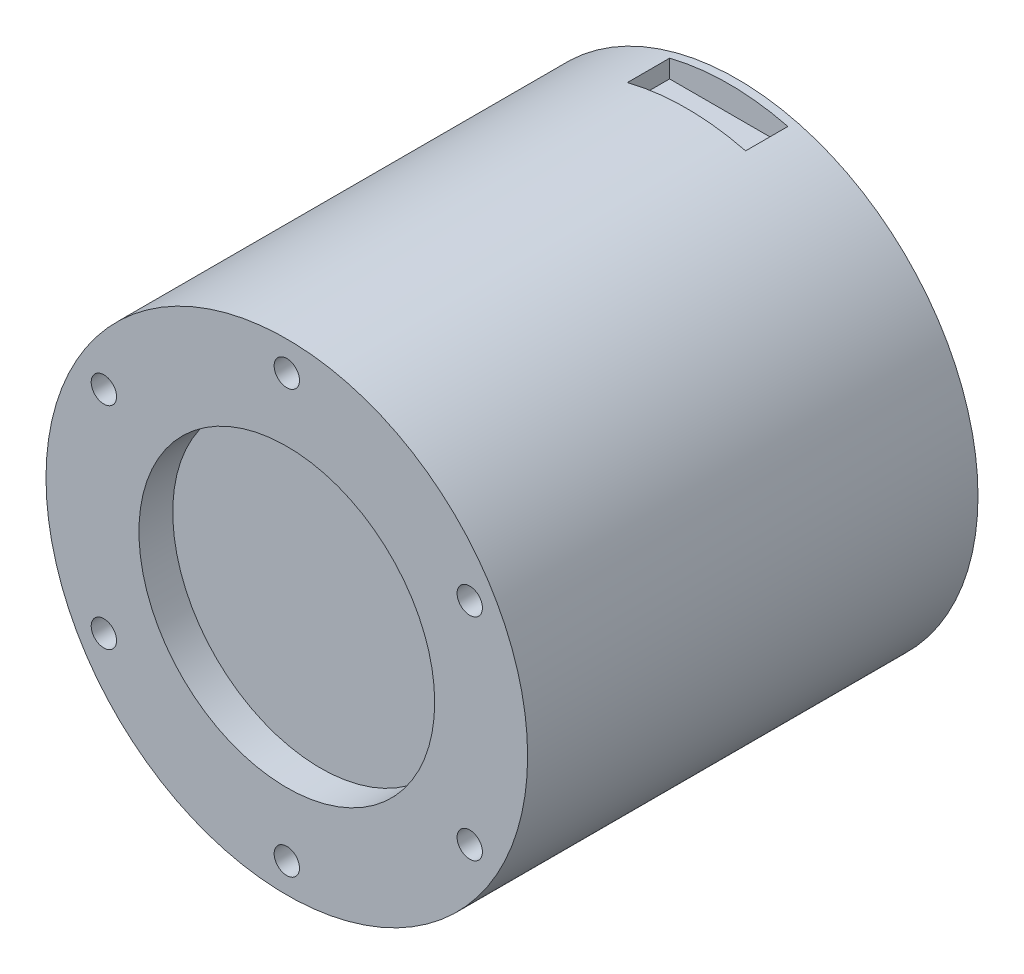
ISO-10303-21;
HEADER;
FILE_DESCRIPTION(('STEP AP214'),'2;1');
FILE_NAME('part.step','',(''),(''),'','','');
FILE_SCHEMA(('AUTOMOTIVE_DESIGN { 1 0 10303 214 1 1 1 1 }'));
ENDSEC;
DATA;
#1=APPLICATION_CONTEXT('core data for automotive mechanical design processes');
#2=APPLICATION_PROTOCOL_DEFINITION('international standard','automotive_design',2000,#1);
#3=PRODUCT_CONTEXT('',#1,'mechanical');
#4=PRODUCT('Part','Part','',(#3));
#5=PRODUCT_RELATED_PRODUCT_CATEGORY('part','',(#4));
#6=PRODUCT_DEFINITION_FORMATION('','',#4);
#7=PRODUCT_DEFINITION_CONTEXT('part definition',#1,'design');
#8=PRODUCT_DEFINITION('design','',#6,#7);
#9=PRODUCT_DEFINITION_SHAPE('','',#8);
#10=(LENGTH_UNIT() NAMED_UNIT(*) SI_UNIT(.MILLI.,.METRE.));
#11=(NAMED_UNIT(*) PLANE_ANGLE_UNIT() SI_UNIT($,.RADIAN.));
#12=(NAMED_UNIT(*) SI_UNIT($,.STERADIAN.) SOLID_ANGLE_UNIT());
#13=UNCERTAINTY_MEASURE_WITH_UNIT(LENGTH_MEASURE(1.E-05),#10,'distance_accuracy_value','');
#14=(GEOMETRIC_REPRESENTATION_CONTEXT(3) GLOBAL_UNCERTAINTY_ASSIGNED_CONTEXT((#13)) GLOBAL_UNIT_ASSIGNED_CONTEXT((#10,
#11,#12)) REPRESENTATION_CONTEXT('',''));
#15=CARTESIAN_POINT('',(0.,0.,0.));
#16=DIRECTION('',(0.,0.,1.));
#17=DIRECTION('',(1.,0.,0.));
#18=AXIS2_PLACEMENT_3D('',#15,#16,#17);
#19=CARTESIAN_POINT('',(0.,0.,53.3));
#20=DIRECTION('',(0.,0.,-1.));
#21=DIRECTION('',(-1.,0.,0.));
#22=AXIS2_PLACEMENT_3D('',#19,#20,#21);
#23=CYLINDRICAL_SURFACE('',#22,28.5);
#24=CARTESIAN_POINT('',(6.99999999976047,27.6269795671433,-4.8311518948453));
#25=CARTESIAN_POINT('',(6.99999999986288,27.6269795671173,-2.0541012632302));
#26=CARTESIAN_POINT('',(6.99999999996529,27.6269795670914,0.722949368384905));
#27=CARTESIAN_POINT('',(7.00000000017012,27.6269795670395,6.27705063161511));
#28=CARTESIAN_POINT('',(7.00000000027253,27.6269795670136,9.0541012632302));
#29=CARTESIAN_POINT('',(7.00000000037494,27.6269795669876,11.8311518948453));
#30=B_SPLINE_CURVE_WITH_KNOTS('',3,(#24,#25,#26,#27,#28,#29),.UNSPECIFIED.,.F.,.F.,(4,2,4),(0.,
8.3311518948453,16.6623037896906),.UNSPECIFIED.);
#31=CARTESIAN_POINT('',(6.99999999997551,27.6269795670888,1.));
#32=VERTEX_POINT('',#31);
#33=CARTESIAN_POINT('',(7.0000000001599,27.6269795670421,6.00000000000001));
#34=VERTEX_POINT('',#33);
#35=EDGE_CURVE('E275',#32,#34,#30,.T.);
#36=ORIENTED_EDGE('',*,*,#35,.T.);
#37=CARTESIAN_POINT('',(0.,0.,6.00000000000001));
#38=DIRECTION('',(0.,0.,1.));
#39=DIRECTION('',(1.,0.,0.));
#40=AXIS2_PLACEMENT_3D('',#37,#38,#39);
#41=CIRCLE('',#40,28.5);
#42=CARTESIAN_POINT('',(-6.9999999998401,27.6269795671231,6.));
#43=VERTEX_POINT('',#42);
#44=EDGE_CURVE('E266',#34,#43,#41,.T.);
#45=ORIENTED_EDGE('',*,*,#44,.T.);
#46=DIRECTION('',(0.,0.,-1.));
#47=VECTOR('',#46,1.);
#48=CARTESIAN_POINT('',(-6.99999999984013,27.6269795671231,53.3));
#49=LINE('',#48,#47);
#50=CARTESIAN_POINT('',(-6.99999999984013,27.6269795671231,1.00000000000001));
#51=VERTEX_POINT('',#50);
#52=EDGE_CURVE('E272',#43,#51,#49,.T.);
#53=ORIENTED_EDGE('',*,*,#52,.T.);
#54=CARTESIAN_POINT('',(0.,0.,1.));
#55=DIRECTION('',(0.,0.,-1.));
#56=DIRECTION('',(-1.,0.,0.));
#57=AXIS2_PLACEMENT_3D('',#54,#55,#56);
#58=CIRCLE('',#57,28.5);
#59=EDGE_CURVE('E59',#51,#32,#58,.T.);
#60=ORIENTED_EDGE('',*,*,#59,.T.);
#61=EDGE_LOOP('',(#36,#45,#53,#60));
#62=FACE_BOUND('',#61,.T.);
#63=CARTESIAN_POINT('',(0.,0.,53.3));
#64=DIRECTION('',(0.,0.,1.));
#65=DIRECTION('',(1.,0.,0.));
#66=AXIS2_PLACEMENT_3D('',#63,#64,#65);
#67=CIRCLE('',#66,28.5);
#68=CARTESIAN_POINT('',(28.5,0.,53.3));
#69=VERTEX_POINT('',#68);
#70=EDGE_CURVE('E263',#69,#69,#67,.T.);
#71=ORIENTED_EDGE('',*,*,#70,.F.);
#72=EDGE_LOOP('',(#71));
#73=FACE_BOUND('',#72,.T.);
#74=CARTESIAN_POINT('',(0.,0.,0.));
#75=DIRECTION('',(0.,0.,1.));
#76=DIRECTION('',(1.,0.,0.));
#77=AXIS2_PLACEMENT_3D('',#74,#75,#76);
#78=CIRCLE('',#77,28.5);
#79=CARTESIAN_POINT('',(28.5,0.,0.));
#80=VERTEX_POINT('',#79);
#81=EDGE_CURVE('E260',#80,#80,#78,.T.);
#82=ORIENTED_EDGE('',*,*,#81,.T.);
#83=EDGE_LOOP('',(#82));
#84=FACE_BOUND('',#83,.T.);
#85=CARTESIAN_POINT('',(0.,0.,6.00000000000001));
#86=DIRECTION('',(0.,0.,-1.));
#87=DIRECTION('',(-1.,0.,0.));
#88=AXIS2_PLACEMENT_3D('',#85,#86,#87);
#89=CIRCLE('',#88,28.5);
#90=CARTESIAN_POINT('',(7.0000000001599,-27.6269795670421,6.));
#91=VERTEX_POINT('',#90);
#92=CARTESIAN_POINT('',(-6.9999999998401,-27.6269795671231,6.00000000000001));
#93=VERTEX_POINT('',#92);
#94=EDGE_CURVE('E283',#91,#93,#89,.T.);
#95=ORIENTED_EDGE('',*,*,#94,.F.);
#96=CARTESIAN_POINT('',(6.99999999976047,-27.6269795671433,-4.8311518948453));
#97=CARTESIAN_POINT('',(6.99999999986288,-27.6269795671173,-2.0541012632302));
#98=CARTESIAN_POINT('',(6.99999999996529,-27.6269795670914,0.722949368384905));
#99=CARTESIAN_POINT('',(7.00000000017012,-27.6269795670395,6.27705063161511));
#100=CARTESIAN_POINT('',(7.00000000027253,-27.6269795670136,9.0541012632302));
#101=CARTESIAN_POINT('',(7.00000000037494,-27.6269795669876,11.8311518948453));
#102=B_SPLINE_CURVE_WITH_KNOTS('',3,(#96,#97,#98,#99,#100,#101),.UNSPECIFIED.,.F.,.F.,(4,2,4),
(0.,8.3311518948453,16.6623037896906),.UNSPECIFIED.);
#103=CARTESIAN_POINT('',(6.99999999997551,-27.6269795670888,1.));
#104=VERTEX_POINT('',#103);
#105=EDGE_CURVE('E420',#104,#91,#102,.T.);
#106=ORIENTED_EDGE('',*,*,#105,.F.);
#107=CARTESIAN_POINT('',(0.,0.,1.));
#108=DIRECTION('',(0.,0.,1.));
#109=DIRECTION('',(1.,0.,0.));
#110=AXIS2_PLACEMENT_3D('',#107,#108,#109);
#111=CIRCLE('',#110,28.5);
#112=CARTESIAN_POINT('',(-6.9999999998401,-27.6269795671231,1.));
#113=VERTEX_POINT('',#112);
#114=EDGE_CURVE('E437',#113,#104,#111,.T.);
#115=ORIENTED_EDGE('',*,*,#114,.F.);
#116=DIRECTION('',(0.,0.,-1.));
#117=VECTOR('',#116,1.);
#118=CARTESIAN_POINT('',(-6.99999999984013,-27.6269795671231,53.3));
#119=LINE('',#118,#117);
#120=EDGE_CURVE('E459',#93,#113,#119,.T.);
#121=ORIENTED_EDGE('',*,*,#120,.F.);
#122=EDGE_LOOP('',(#95,#106,#115,#121));
#123=FACE_BOUND('',#122,.T.);
#124=CARTESIAN_POINT('',(0.,0.,1.));
#125=DIRECTION('',(0.,0.,1.));
#126=DIRECTION('',(0.,-1.,0.));
#127=AXIS2_PLACEMENT_3D('',#124,#125,#126);
#128=CIRCLE('',#127,28.5);
#129=CARTESIAN_POINT('',(-28.2179021190449,4.,1.));
#130=VERTEX_POINT('',#129);
#131=CARTESIAN_POINT('',(-28.2179021190449,-4.,1.));
#132=VERTEX_POINT('',#131);
#133=EDGE_CURVE('E415',#130,#132,#128,.T.);
#134=ORIENTED_EDGE('',*,*,#133,.F.);
#135=DIRECTION('',(0.,0.,-1.));
#136=VECTOR('',#135,1.);
#137=CARTESIAN_POINT('',(-28.2179021190449,4.,53.3));
#138=LINE('',#137,#136);
#139=CARTESIAN_POINT('',(-28.2179021190449,4.,9.));
#140=VERTEX_POINT('',#139);
#141=EDGE_CURVE('E11',#140,#130,#138,.T.);
#142=ORIENTED_EDGE('',*,*,#141,.F.);
#143=CARTESIAN_POINT('',(0.,0.,9.));
#144=DIRECTION('',(0.,0.,-1.));
#145=DIRECTION('',(-1.,0.,0.));
#146=AXIS2_PLACEMENT_3D('',#143,#144,#145);
#147=CIRCLE('',#146,28.5);
#148=CARTESIAN_POINT('',(-28.2179021190449,-4.,9.));
#149=VERTEX_POINT('',#148);
#150=EDGE_CURVE('E44',#149,#140,#147,.T.);
#151=ORIENTED_EDGE('',*,*,#150,.F.);
#152=DIRECTION('',(0.,0.,-1.));
#153=VECTOR('',#152,1.);
#154=CARTESIAN_POINT('',(-28.2179021190449,-4.,53.3));
#155=LINE('',#154,#153);
#156=EDGE_CURVE('E416',#132,#149,#155,.F.);
#157=ORIENTED_EDGE('',*,*,#156,.F.);
#158=EDGE_LOOP('',(#134,#142,#151,#157));
#159=FACE_BOUND('',#158,.T.);
#160=ADVANCED_FACE('F36',(#62,#73,#84,#123,#159),#23,.T.);
#161=CARTESIAN_POINT('',(0.,0.,53.3));
#162=DIRECTION('',(0.,0.,1.));
#163=DIRECTION('',(1.,0.,0.));
#164=AXIS2_PLACEMENT_3D('',#161,#162,#163);
#165=PLANE('',#164);
#166=CARTESIAN_POINT('',(0.,25.,53.3));
#167=DIRECTION('',(0.,0.,1.));
#168=DIRECTION('',(1.,0.,0.));
#169=AXIS2_PLACEMENT_3D('',#166,#167,#168);
#170=CIRCLE('',#169,1.5);
#171=CARTESIAN_POINT('',(1.5,25.,53.3));
#172=VERTEX_POINT('',#171);
#173=EDGE_CURVE('E225',#172,#172,#170,.T.);
#174=ORIENTED_EDGE('',*,*,#173,.F.);
#175=EDGE_LOOP('',(#174));
#176=FACE_BOUND('',#175,.T.);
#177=CARTESIAN_POINT('',(-21.6506350946105,12.4999999999991,53.3));
#178=DIRECTION('',(0.,0.,1.));
#179=DIRECTION('',(1.,0.,0.));
#180=AXIS2_PLACEMENT_3D('',#177,#178,#179);
#181=CIRCLE('',#180,1.5);
#182=CARTESIAN_POINT('',(-20.1506350946105,12.4999999999991,53.3));
#183=VERTEX_POINT('',#182);
#184=EDGE_CURVE('E229',#183,#183,#181,.T.);
#185=ORIENTED_EDGE('',*,*,#184,.F.);
#186=EDGE_LOOP('',(#185));
#187=FACE_BOUND('',#186,.T.);
#188=CARTESIAN_POINT('',(-21.6506350946095,-12.5000000000009,53.3));
#189=DIRECTION('',(0.,0.,1.));
#190=DIRECTION('',(1.,0.,0.));
#191=AXIS2_PLACEMENT_3D('',#188,#189,#190);
#192=CIRCLE('',#191,1.5);
#193=CARTESIAN_POINT('',(-20.1506350946095,-12.5000000000009,53.3));
#194=VERTEX_POINT('',#193);
#195=EDGE_CURVE('E252',#194,#194,#192,.T.);
#196=ORIENTED_EDGE('',*,*,#195,.F.);
#197=EDGE_LOOP('',(#196));
#198=FACE_BOUND('',#197,.T.);
#199=CARTESIAN_POINT('',(2.01647426932225E-12,-25.,53.3));
#200=DIRECTION('',(0.,0.,1.));
#201=DIRECTION('',(1.,0.,0.));
#202=AXIS2_PLACEMENT_3D('',#199,#200,#201);
#203=CIRCLE('',#202,1.5);
#204=CARTESIAN_POINT('',(1.50000000000202,-25.,53.3));
#205=VERTEX_POINT('',#204);
#206=EDGE_CURVE('E246',#205,#205,#203,.T.);
#207=ORIENTED_EDGE('',*,*,#206,.F.);
#208=EDGE_LOOP('',(#207));
#209=FACE_BOUND('',#208,.T.);
#210=CARTESIAN_POINT('',(21.6506350946125,-12.4999999999991,53.3));
#211=DIRECTION('',(0.,0.,1.));
#212=DIRECTION('',(1.,0.,0.));
#213=AXIS2_PLACEMENT_3D('',#210,#211,#212);
#214=CIRCLE('',#213,1.5);
#215=CARTESIAN_POINT('',(23.1506350946125,-12.4999999999991,53.3));
#216=VERTEX_POINT('',#215);
#217=EDGE_CURVE('E240',#216,#216,#214,.T.);
#218=ORIENTED_EDGE('',*,*,#217,.F.);
#219=EDGE_LOOP('',(#218));
#220=FACE_BOUND('',#219,.T.);
#221=CARTESIAN_POINT('',(21.6506350946115,12.5000000000009,53.3));
#222=DIRECTION('',(0.,0.,1.));
#223=DIRECTION('',(1.,0.,0.));
#224=AXIS2_PLACEMENT_3D('',#221,#222,#223);
#225=CIRCLE('',#224,1.5);
#226=CARTESIAN_POINT('',(23.1506350946115,12.5000000000009,53.3));
#227=VERTEX_POINT('',#226);
#228=EDGE_CURVE('E228',#227,#227,#225,.T.);
#229=ORIENTED_EDGE('',*,*,#228,.F.);
#230=EDGE_LOOP('',(#229));
#231=FACE_BOUND('',#230,.T.);
#232=CARTESIAN_POINT('',(0.,0.,53.3));
#233=DIRECTION('',(0.,0.,1.));
#234=DIRECTION('',(1.,0.,0.));
#235=AXIS2_PLACEMENT_3D('',#232,#233,#234);
#236=CIRCLE('',#235,17.5);
#237=CARTESIAN_POINT('',(17.5,0.,53.3));
#238=VERTEX_POINT('',#237);
#239=EDGE_CURVE('E224',#238,#238,#236,.T.);
#240=ORIENTED_EDGE('',*,*,#239,.F.);
#241=EDGE_LOOP('',(#240));
#242=FACE_BOUND('',#241,.T.);
#243=ORIENTED_EDGE('',*,*,#70,.T.);
#244=EDGE_LOOP('',(#243));
#245=FACE_BOUND('',#244,.T.);
#246=ADVANCED_FACE('F393',(#176,#187,#198,#209,#220,#231,#242,#245),#165,.T.);
#247=CARTESIAN_POINT('',(0.,0.,0.));
#248=DIRECTION('',(0.,0.,1.));
#249=DIRECTION('',(1.,0.,0.));
#250=AXIS2_PLACEMENT_3D('',#247,#248,#249);
#251=PLANE('',#250);
#252=CARTESIAN_POINT('',(13.4350288425436,-13.4350288425444,0.));
#253=DIRECTION('',(0.,0.,-1.));
#254=DIRECTION('',(-1.,0.,0.));
#255=AXIS2_PLACEMENT_3D('',#252,#253,#254);
#256=CIRCLE('',#255,1.5000000000004);
#257=CARTESIAN_POINT('',(11.9350288425432,-13.4350288425444,0.));
#258=VERTEX_POINT('',#257);
#259=EDGE_CURVE('E210',#258,#258,#256,.T.);
#260=ORIENTED_EDGE('',*,*,#259,.F.);
#261=EDGE_LOOP('',(#260));
#262=FACE_BOUND('',#261,.T.);
#263=CARTESIAN_POINT('',(-13.4350288425452,-13.4350288425436,0.));
#264=DIRECTION('',(0.,0.,-1.));
#265=DIRECTION('',(-1.,0.,0.));
#266=AXIS2_PLACEMENT_3D('',#263,#264,#265);
#267=CIRCLE('',#266,1.50000000000106);
#268=CARTESIAN_POINT('',(-14.9350288425462,-13.4350288425436,0.));
#269=VERTEX_POINT('',#268);
#270=EDGE_CURVE('E204',#269,#269,#267,.T.);
#271=ORIENTED_EDGE('',*,*,#270,.F.);
#272=EDGE_LOOP('',(#271));
#273=FACE_BOUND('',#272,.T.);
#274=CARTESIAN_POINT('',(-13.4350288425444,13.4350288425452,0.));
#275=DIRECTION('',(0.,0.,-1.));
#276=DIRECTION('',(-1.,0.,0.));
#277=AXIS2_PLACEMENT_3D('',#274,#275,#276);
#278=CIRCLE('',#277,1.50000000000078);
#279=CARTESIAN_POINT('',(-14.9350288425452,13.4350288425452,0.));
#280=VERTEX_POINT('',#279);
#281=EDGE_CURVE('E197',#280,#280,#278,.T.);
#282=ORIENTED_EDGE('',*,*,#281,.F.);
#283=EDGE_LOOP('',(#282));
#284=FACE_BOUND('',#283,.T.);
#285=CARTESIAN_POINT('',(13.4350288425444,13.4350288425444,0.));
#286=DIRECTION('',(0.,0.,-1.));
#287=DIRECTION('',(-1.,0.,0.));
#288=AXIS2_PLACEMENT_3D('',#285,#286,#287);
#289=CIRCLE('',#288,1.5);
#290=CARTESIAN_POINT('',(11.9350288425444,13.4350288425444,0.));
#291=VERTEX_POINT('',#290);
#292=EDGE_CURVE('E200',#291,#291,#289,.T.);
#293=ORIENTED_EDGE('',*,*,#292,.F.);
#294=EDGE_LOOP('',(#293));
#295=FACE_BOUND('',#294,.T.);
#296=ORIENTED_EDGE('',*,*,#81,.F.);
#297=EDGE_LOOP('',(#296));
#298=FACE_BOUND('',#297,.T.);
#299=ADVANCED_FACE('F391',(#262,#273,#284,#295,#298),#251,.F.);
#300=CARTESIAN_POINT('',(0.,0.,49.3));
#301=DIRECTION('',(0.,0.,1.));
#302=DIRECTION('',(1.,0.,0.));
#303=AXIS2_PLACEMENT_3D('',#300,#301,#302);
#304=CYLINDRICAL_SURFACE('',#303,17.5);
#305=CARTESIAN_POINT('',(0.,0.,49.3));
#306=DIRECTION('',(0.,0.,1.));
#307=DIRECTION('',(1.,0.,0.));
#308=AXIS2_PLACEMENT_3D('',#305,#306,#307);
#309=CIRCLE('',#308,17.5);
#310=CARTESIAN_POINT('',(17.5,0.,49.3));
#311=VERTEX_POINT('',#310);
#312=EDGE_CURVE('E257',#311,#311,#309,.T.);
#313=ORIENTED_EDGE('',*,*,#312,.F.);
#314=EDGE_LOOP('',(#313));
#315=FACE_BOUND('',#314,.T.);
#316=ORIENTED_EDGE('',*,*,#239,.T.);
#317=EDGE_LOOP('',(#316));
#318=FACE_BOUND('',#317,.T.);
#319=ADVANCED_FACE('F387',(#315,#318),#304,.F.);
#320=CARTESIAN_POINT('',(0.,0.,49.3));
#321=DIRECTION('',(0.,0.,1.));
#322=DIRECTION('',(1.,0.,0.));
#323=AXIS2_PLACEMENT_3D('',#320,#321,#322);
#324=PLANE('',#323);
#325=ORIENTED_EDGE('',*,*,#312,.T.);
#326=EDGE_LOOP('',(#325));
#327=FACE_BOUND('',#326,.T.);
#328=ADVANCED_FACE('F357',(#327),#324,.T.);
#329=CARTESIAN_POINT('',(21.6506350946115,12.5000000000009,48.3));
#330=DIRECTION('',(0.,0.,1.));
#331=DIRECTION('',(1.,0.,0.));
#332=AXIS2_PLACEMENT_3D('',#329,#330,#331);
#333=CYLINDRICAL_SURFACE('',#332,1.5);
#334=CARTESIAN_POINT('',(21.6506350946115,12.5000000000009,48.3));
#335=DIRECTION('',(0.,0.,1.));
#336=DIRECTION('',(1.,0.,0.));
#337=AXIS2_PLACEMENT_3D('',#334,#335,#336);
#338=CIRCLE('',#337,1.5);
#339=CARTESIAN_POINT('',(23.1506350946115,12.5000000000009,48.3));
#340=VERTEX_POINT('',#339);
#341=EDGE_CURVE('E237',#340,#340,#338,.T.);
#342=ORIENTED_EDGE('',*,*,#341,.F.);
#343=EDGE_LOOP('',(#342));
#344=FACE_BOUND('',#343,.T.);
#345=ORIENTED_EDGE('',*,*,#228,.T.);
#346=EDGE_LOOP('',(#345));
#347=FACE_BOUND('',#346,.T.);
#348=ADVANCED_FACE('F353',(#344,#347),#333,.F.);
#349=CARTESIAN_POINT('',(21.6506350946115,12.5000000000009,48.3));
#350=DIRECTION('',(0.,0.,1.));
#351=DIRECTION('',(1.,0.,0.));
#352=AXIS2_PLACEMENT_3D('',#349,#350,#351);
#353=PLANE('',#352);
#354=ORIENTED_EDGE('',*,*,#341,.T.);
#355=EDGE_LOOP('',(#354));
#356=FACE_BOUND('',#355,.T.);
#357=ADVANCED_FACE('F356',(#356),#353,.T.);
#358=CARTESIAN_POINT('',(21.6506350946125,-12.4999999999991,48.3));
#359=DIRECTION('',(0.,0.,1.));
#360=DIRECTION('',(1.,0.,0.));
#361=AXIS2_PLACEMENT_3D('',#358,#359,#360);
#362=CYLINDRICAL_SURFACE('',#361,1.5);
#363=CARTESIAN_POINT('',(21.6506350946125,-12.4999999999991,48.3));
#364=DIRECTION('',(0.,0.,1.));
#365=DIRECTION('',(1.,0.,0.));
#366=AXIS2_PLACEMENT_3D('',#363,#364,#365);
#367=CIRCLE('',#366,1.5);
#368=CARTESIAN_POINT('',(23.1506350946125,-12.4999999999991,48.3));
#369=VERTEX_POINT('',#368);
#370=EDGE_CURVE('E243',#369,#369,#367,.T.);
#371=ORIENTED_EDGE('',*,*,#370,.F.);
#372=EDGE_LOOP('',(#371));
#373=FACE_BOUND('',#372,.T.);
#374=ORIENTED_EDGE('',*,*,#217,.T.);
#375=EDGE_LOOP('',(#374));
#376=FACE_BOUND('',#375,.T.);
#377=ADVANCED_FACE('F361',(#373,#376),#362,.F.);
#378=CARTESIAN_POINT('',(21.6506350946125,-12.4999999999991,48.3));
#379=DIRECTION('',(0.,0.,1.));
#380=DIRECTION('',(1.,0.,0.));
#381=AXIS2_PLACEMENT_3D('',#378,#379,#380);
#382=PLANE('',#381);
#383=ORIENTED_EDGE('',*,*,#370,.T.);
#384=EDGE_LOOP('',(#383));
#385=FACE_BOUND('',#384,.T.);
#386=ADVANCED_FACE('F365',(#385),#382,.T.);
#387=CARTESIAN_POINT('',(2.01647426932225E-12,-25.,48.3));
#388=DIRECTION('',(0.,0.,1.));
#389=DIRECTION('',(1.,0.,0.));
#390=AXIS2_PLACEMENT_3D('',#387,#388,#389);
#391=CYLINDRICAL_SURFACE('',#390,1.5);
#392=CARTESIAN_POINT('',(2.01647426932225E-12,-25.,48.3));
#393=DIRECTION('',(0.,0.,1.));
#394=DIRECTION('',(1.,0.,0.));
#395=AXIS2_PLACEMENT_3D('',#392,#393,#394);
#396=CIRCLE('',#395,1.5);
#397=CARTESIAN_POINT('',(1.50000000000202,-25.,48.3));
#398=VERTEX_POINT('',#397);
#399=EDGE_CURVE('E249',#398,#398,#396,.T.);
#400=ORIENTED_EDGE('',*,*,#399,.F.);
#401=EDGE_LOOP('',(#400));
#402=FACE_BOUND('',#401,.T.);
#403=ORIENTED_EDGE('',*,*,#206,.T.);
#404=EDGE_LOOP('',(#403));
#405=FACE_BOUND('',#404,.T.);
#406=ADVANCED_FACE('F369',(#402,#405),#391,.F.);
#407=CARTESIAN_POINT('',(2.01647426932225E-12,-25.,48.3));
#408=DIRECTION('',(0.,0.,1.));
#409=DIRECTION('',(1.,0.,0.));
#410=AXIS2_PLACEMENT_3D('',#407,#408,#409);
#411=PLANE('',#410);
#412=ORIENTED_EDGE('',*,*,#399,.T.);
#413=EDGE_LOOP('',(#412));
#414=FACE_BOUND('',#413,.T.);
#415=ADVANCED_FACE('F373',(#414),#411,.T.);
#416=CARTESIAN_POINT('',(-21.6506350946095,-12.5000000000009,48.3));
#417=DIRECTION('',(0.,0.,1.));
#418=DIRECTION('',(1.,0.,0.));
#419=AXIS2_PLACEMENT_3D('',#416,#417,#418);
#420=CYLINDRICAL_SURFACE('',#419,1.5);
#421=CARTESIAN_POINT('',(-21.6506350946095,-12.5000000000009,48.3));
#422=DIRECTION('',(0.,0.,1.));
#423=DIRECTION('',(1.,0.,0.));
#424=AXIS2_PLACEMENT_3D('',#421,#422,#423);
#425=CIRCLE('',#424,1.5);
#426=CARTESIAN_POINT('',(-20.1506350946095,-12.5000000000009,48.3));
#427=VERTEX_POINT('',#426);
#428=EDGE_CURVE('E232',#427,#427,#425,.T.);
#429=ORIENTED_EDGE('',*,*,#428,.F.);
#430=EDGE_LOOP('',(#429));
#431=FACE_BOUND('',#430,.T.);
#432=ORIENTED_EDGE('',*,*,#195,.T.);
#433=EDGE_LOOP('',(#432));
#434=FACE_BOUND('',#433,.T.);
#435=ADVANCED_FACE('F377',(#431,#434),#420,.F.);
#436=CARTESIAN_POINT('',(-21.6506350946095,-12.5000000000009,48.3));
#437=DIRECTION('',(0.,0.,1.));
#438=DIRECTION('',(1.,0.,0.));
#439=AXIS2_PLACEMENT_3D('',#436,#437,#438);
#440=PLANE('',#439);
#441=ORIENTED_EDGE('',*,*,#428,.T.);
#442=EDGE_LOOP('',(#441));
#443=FACE_BOUND('',#442,.T.);
#444=ADVANCED_FACE('F348',(#443),#440,.T.);
#445=CARTESIAN_POINT('',(-21.6506350946105,12.4999999999991,48.3));
#446=DIRECTION('',(0.,0.,1.));
#447=DIRECTION('',(1.,0.,0.));
#448=AXIS2_PLACEMENT_3D('',#445,#446,#447);
#449=CYLINDRICAL_SURFACE('',#448,1.5);
#450=CARTESIAN_POINT('',(-21.6506350946105,12.4999999999991,48.3));
#451=DIRECTION('',(0.,0.,1.));
#452=DIRECTION('',(1.,0.,0.));
#453=AXIS2_PLACEMENT_3D('',#450,#451,#452);
#454=CIRCLE('',#453,1.5);
#455=CARTESIAN_POINT('',(-20.1506350946105,12.4999999999991,48.3));
#456=VERTEX_POINT('',#455);
#457=EDGE_CURVE('E218',#456,#456,#454,.T.);
#458=ORIENTED_EDGE('',*,*,#457,.F.);
#459=EDGE_LOOP('',(#458));
#460=FACE_BOUND('',#459,.T.);
#461=ORIENTED_EDGE('',*,*,#184,.T.);
#462=EDGE_LOOP('',(#461));
#463=FACE_BOUND('',#462,.T.);
#464=ADVANCED_FACE('F345',(#460,#463),#449,.F.);
#465=CARTESIAN_POINT('',(-21.6506350946105,12.4999999999991,48.3));
#466=DIRECTION('',(0.,0.,1.));
#467=DIRECTION('',(1.,0.,0.));
#468=AXIS2_PLACEMENT_3D('',#465,#466,#467);
#469=PLANE('',#468);
#470=ORIENTED_EDGE('',*,*,#457,.T.);
#471=EDGE_LOOP('',(#470));
#472=FACE_BOUND('',#471,.T.);
#473=ADVANCED_FACE('F343',(#472),#469,.T.);
#474=CARTESIAN_POINT('',(0.,25.,48.3));
#475=DIRECTION('',(0.,0.,1.));
#476=DIRECTION('',(1.,0.,0.));
#477=AXIS2_PLACEMENT_3D('',#474,#475,#476);
#478=CYLINDRICAL_SURFACE('',#477,1.5);
#479=CARTESIAN_POINT('',(0.,25.,48.3));
#480=DIRECTION('',(0.,0.,1.));
#481=DIRECTION('',(1.,0.,0.));
#482=AXIS2_PLACEMENT_3D('',#479,#480,#481);
#483=CIRCLE('',#482,1.5);
#484=CARTESIAN_POINT('',(1.5,25.,48.3));
#485=VERTEX_POINT('',#484);
#486=EDGE_CURVE('E221',#485,#485,#483,.T.);
#487=ORIENTED_EDGE('',*,*,#486,.F.);
#488=EDGE_LOOP('',(#487));
#489=FACE_BOUND('',#488,.T.);
#490=ORIENTED_EDGE('',*,*,#173,.T.);
#491=EDGE_LOOP('',(#490));
#492=FACE_BOUND('',#491,.T.);
#493=ADVANCED_FACE('F339',(#489,#492),#478,.F.);
#494=CARTESIAN_POINT('',(0.,25.,48.3));
#495=DIRECTION('',(0.,0.,1.));
#496=DIRECTION('',(1.,0.,0.));
#497=AXIS2_PLACEMENT_3D('',#494,#495,#496);
#498=PLANE('',#497);
#499=ORIENTED_EDGE('',*,*,#486,.T.);
#500=EDGE_LOOP('',(#499));
#501=FACE_BOUND('',#500,.T.);
#502=ADVANCED_FACE('F335',(#501),#498,.T.);
#503=CARTESIAN_POINT('',(13.4350288425444,13.4350288425444,4.));
#504=DIRECTION('',(0.,0.,-1.));
#505=DIRECTION('',(-1.,0.,0.));
#506=AXIS2_PLACEMENT_3D('',#503,#504,#505);
#507=CYLINDRICAL_SURFACE('',#506,1.5);
#508=CARTESIAN_POINT('',(13.4350288425444,13.4350288425444,4.));
#509=DIRECTION('',(0.,0.,-1.));
#510=DIRECTION('',(-1.,0.,0.));
#511=AXIS2_PLACEMENT_3D('',#508,#509,#510);
#512=CIRCLE('',#511,1.5);
#513=CARTESIAN_POINT('',(11.9350288425444,13.4350288425444,4.));
#514=VERTEX_POINT('',#513);
#515=EDGE_CURVE('E215',#514,#514,#512,.T.);
#516=ORIENTED_EDGE('',*,*,#515,.F.);
#517=EDGE_LOOP('',(#516));
#518=FACE_BOUND('',#517,.T.);
#519=ORIENTED_EDGE('',*,*,#292,.T.);
#520=EDGE_LOOP('',(#519));
#521=FACE_BOUND('',#520,.T.);
#522=ADVANCED_FACE('F331',(#518,#521),#507,.F.);
#523=CARTESIAN_POINT('',(13.4350288425444,13.4350288425444,4.));
#524=DIRECTION('',(0.,0.,-1.));
#525=DIRECTION('',(-1.,0.,0.));
#526=AXIS2_PLACEMENT_3D('',#523,#524,#525);
#527=PLANE('',#526);
#528=ORIENTED_EDGE('',*,*,#515,.T.);
#529=EDGE_LOOP('',(#528));
#530=FACE_BOUND('',#529,.T.);
#531=ADVANCED_FACE('F309',(#530),#527,.T.);
#532=CARTESIAN_POINT('',(-13.4350288425444,13.4350288425452,4.));
#533=DIRECTION('',(0.,0.,-1.));
#534=DIRECTION('',(-1.,0.,0.));
#535=AXIS2_PLACEMENT_3D('',#532,#533,#534);
#536=CYLINDRICAL_SURFACE('',#535,1.50000000000078);
#537=CARTESIAN_POINT('',(-13.4350288425444,13.4350288425452,4.));
#538=DIRECTION('',(0.,0.,-1.));
#539=DIRECTION('',(-1.,0.,0.));
#540=AXIS2_PLACEMENT_3D('',#537,#538,#539);
#541=CIRCLE('',#540,1.50000000000078);
#542=CARTESIAN_POINT('',(-14.9350288425452,13.4350288425452,4.));
#543=VERTEX_POINT('',#542);
#544=EDGE_CURVE('E201',#543,#543,#541,.T.);
#545=ORIENTED_EDGE('',*,*,#544,.F.);
#546=EDGE_LOOP('',(#545));
#547=FACE_BOUND('',#546,.T.);
#548=ORIENTED_EDGE('',*,*,#281,.T.);
#549=EDGE_LOOP('',(#548));
#550=FACE_BOUND('',#549,.T.);
#551=ADVANCED_FACE('F305',(#547,#550),#536,.F.);
#552=CARTESIAN_POINT('',(-13.4350288425444,13.4350288425452,4.));
#553=DIRECTION('',(0.,0.,-1.));
#554=DIRECTION('',(-1.,0.,0.));
#555=AXIS2_PLACEMENT_3D('',#552,#553,#554);
#556=PLANE('',#555);
#557=ORIENTED_EDGE('',*,*,#544,.T.);
#558=EDGE_LOOP('',(#557));
#559=FACE_BOUND('',#558,.T.);
#560=ADVANCED_FACE('F308',(#559),#556,.T.);
#561=CARTESIAN_POINT('',(-13.4350288425452,-13.4350288425436,4.));
#562=DIRECTION('',(0.,0.,-1.));
#563=DIRECTION('',(-1.,0.,0.));
#564=AXIS2_PLACEMENT_3D('',#561,#562,#563);
#565=CYLINDRICAL_SURFACE('',#564,1.50000000000106);
#566=CARTESIAN_POINT('',(-13.4350288425452,-13.4350288425436,4.));
#567=DIRECTION('',(0.,0.,-1.));
#568=DIRECTION('',(-1.,0.,0.));
#569=AXIS2_PLACEMENT_3D('',#566,#567,#568);
#570=CIRCLE('',#569,1.50000000000106);
#571=CARTESIAN_POINT('',(-14.9350288425462,-13.4350288425436,4.));
#572=VERTEX_POINT('',#571);
#573=EDGE_CURVE('E207',#572,#572,#570,.T.);
#574=ORIENTED_EDGE('',*,*,#573,.F.);
#575=EDGE_LOOP('',(#574));
#576=FACE_BOUND('',#575,.T.);
#577=ORIENTED_EDGE('',*,*,#270,.T.);
#578=EDGE_LOOP('',(#577));
#579=FACE_BOUND('',#578,.T.);
#580=ADVANCED_FACE('F313',(#576,#579),#565,.F.);
#581=CARTESIAN_POINT('',(-13.4350288425452,-13.4350288425436,4.));
#582=DIRECTION('',(0.,0.,-1.));
#583=DIRECTION('',(-1.,0.,0.));
#584=AXIS2_PLACEMENT_3D('',#581,#582,#583);
#585=PLANE('',#584);
#586=ORIENTED_EDGE('',*,*,#573,.T.);
#587=EDGE_LOOP('',(#586));
#588=FACE_BOUND('',#587,.T.);
#589=ADVANCED_FACE('F317',(#588),#585,.T.);
#590=CARTESIAN_POINT('',(13.4350288425436,-13.4350288425444,4.));
#591=DIRECTION('',(0.,0.,-1.));
#592=DIRECTION('',(-1.,0.,0.));
#593=AXIS2_PLACEMENT_3D('',#590,#591,#592);
#594=CYLINDRICAL_SURFACE('',#593,1.5000000000004);
#595=CARTESIAN_POINT('',(13.4350288425436,-13.4350288425444,4.));
#596=DIRECTION('',(0.,0.,-1.));
#597=DIRECTION('',(-1.,0.,0.));
#598=AXIS2_PLACEMENT_3D('',#595,#596,#597);
#599=CIRCLE('',#598,1.5000000000004);
#600=CARTESIAN_POINT('',(11.9350288425432,-13.4350288425444,4.));
#601=VERTEX_POINT('',#600);
#602=EDGE_CURVE('E189',#601,#601,#599,.T.);
#603=ORIENTED_EDGE('',*,*,#602,.F.);
#604=EDGE_LOOP('',(#603));
#605=FACE_BOUND('',#604,.T.);
#606=ORIENTED_EDGE('',*,*,#259,.T.);
#607=EDGE_LOOP('',(#606));
#608=FACE_BOUND('',#607,.T.);
#609=ADVANCED_FACE('F321',(#605,#608),#594,.F.);
#610=CARTESIAN_POINT('',(13.4350288425436,-13.4350288425444,4.));
#611=DIRECTION('',(0.,0.,-1.));
#612=DIRECTION('',(-1.,0.,0.));
#613=AXIS2_PLACEMENT_3D('',#610,#611,#612);
#614=PLANE('',#613);
#615=ORIENTED_EDGE('',*,*,#602,.T.);
#616=EDGE_LOOP('',(#615));
#617=FACE_BOUND('',#616,.T.);
#618=ADVANCED_FACE('F304',(#617),#614,.T.);
#619=CARTESIAN_POINT('',(-6.9999999998401,25.5,1.));
#620=DIRECTION('',(0.,0.,-1.));
#621=DIRECTION('',(-1.,0.,0.));
#622=AXIS2_PLACEMENT_3D('',#619,#620,#621);
#623=PLANE('',#622);
#624=DIRECTION('',(0.,1.,0.));
#625=VECTOR('',#624,1.);
#626=CARTESIAN_POINT('',(-6.9999999998401,25.5,1.));
#627=LINE('',#626,#625);
#628=CARTESIAN_POINT('',(-6.9999999998401,25.5,1.));
#629=VERTEX_POINT('',#628);
#630=EDGE_CURVE('E186',#629,#51,#627,.T.);
#631=ORIENTED_EDGE('',*,*,#630,.F.);
#632=DIRECTION('',(-1.,0.,0.));
#633=VECTOR('',#632,1.);
#634=CARTESIAN_POINT('',(-6.9999999998401,25.5,1.));
#635=LINE('',#634,#633);
#636=CARTESIAN_POINT('',(6.99999999997551,25.5,1.));
#637=VERTEX_POINT('',#636);
#638=EDGE_CURVE('E167',#637,#629,#635,.T.);
#639=ORIENTED_EDGE('',*,*,#638,.F.);
#640=DIRECTION('',(0.,1.,0.));
#641=VECTOR('',#640,1.);
#642=CARTESIAN_POINT('',(6.99999999997551,25.5,1.));
#643=LINE('',#642,#641);
#644=EDGE_CURVE('E187',#637,#32,#643,.T.);
#645=ORIENTED_EDGE('',*,*,#644,.T.);
#646=ORIENTED_EDGE('',*,*,#59,.F.);
#647=EDGE_LOOP('',(#631,#639,#645,#646));
#648=FACE_BOUND('',#647,.T.);
#649=ADVANCED_FACE('F291',(#648),#623,.F.);
#650=CARTESIAN_POINT('',(7.0000000001599,25.5,6.));
#651=DIRECTION('',(1.,0.,-3.68781394310957E-11));
#652=DIRECTION('',(-3.68781394310957E-11,0.,-1.));
#653=AXIS2_PLACEMENT_3D('',#650,#651,#652);
#654=PLANE('',#653);
#655=ORIENTED_EDGE('',*,*,#644,.F.);
#656=DIRECTION('',(-3.68781394310957E-11,0.,-1.));
#657=VECTOR('',#656,1.);
#658=CARTESIAN_POINT('',(7.0000000001599,25.5,6.));
#659=LINE('',#658,#657);
#660=CARTESIAN_POINT('',(7.0000000001599,25.5,6.));
#661=VERTEX_POINT('',#660);
#662=EDGE_CURVE('E183',#661,#637,#659,.T.);
#663=ORIENTED_EDGE('',*,*,#662,.F.);
#664=DIRECTION('',(0.,1.,0.));
#665=VECTOR('',#664,1.);
#666=CARTESIAN_POINT('',(7.0000000001599,25.5,6.));
#667=LINE('',#666,#665);
#668=EDGE_CURVE('E190',#661,#34,#667,.T.);
#669=ORIENTED_EDGE('',*,*,#668,.T.);
#670=ORIENTED_EDGE('',*,*,#35,.F.);
#671=EDGE_LOOP('',(#655,#663,#669,#670));
#672=FACE_BOUND('',#671,.T.);
#673=ADVANCED_FACE('F285',(#672),#654,.F.);
#674=CARTESIAN_POINT('',(-6.9999999998401,25.5,6.));
#675=DIRECTION('',(0.,0.,1.));
#676=DIRECTION('',(1.,0.,0.));
#677=AXIS2_PLACEMENT_3D('',#674,#675,#676);
#678=PLANE('',#677);
#679=ORIENTED_EDGE('',*,*,#668,.F.);
#680=DIRECTION('',(1.,0.,0.));
#681=VECTOR('',#680,1.);
#682=CARTESIAN_POINT('',(-6.9999999998401,25.5,6.));
#683=LINE('',#682,#681);
#684=CARTESIAN_POINT('',(-6.9999999998401,25.5,6.));
#685=VERTEX_POINT('',#684);
#686=EDGE_CURVE('E180',#685,#661,#683,.T.);
#687=ORIENTED_EDGE('',*,*,#686,.F.);
#688=DIRECTION('',(0.,1.,0.));
#689=VECTOR('',#688,1.);
#690=CARTESIAN_POINT('',(-6.9999999998401,25.5,6.));
#691=LINE('',#690,#689);
#692=EDGE_CURVE('E193',#685,#43,#691,.T.);
#693=ORIENTED_EDGE('',*,*,#692,.T.);
#694=ORIENTED_EDGE('',*,*,#44,.F.);
#695=EDGE_LOOP('',(#679,#687,#693,#694));
#696=FACE_BOUND('',#695,.T.);
#697=ADVANCED_FACE('F290',(#696),#678,.F.);
#698=CARTESIAN_POINT('',(-6.9999999998401,25.5,1.));
#699=DIRECTION('',(-1.,0.,0.));
#700=DIRECTION('',(0.,0.,1.));
#701=AXIS2_PLACEMENT_3D('',#698,#699,#700);
#702=PLANE('',#701);
#703=ORIENTED_EDGE('',*,*,#692,.F.);
#704=DIRECTION('',(0.,0.,1.));
#705=VECTOR('',#704,1.);
#706=CARTESIAN_POINT('',(-6.9999999998401,25.5,1.));
#707=LINE('',#706,#705);
#708=EDGE_CURVE('E177',#629,#685,#707,.T.);
#709=ORIENTED_EDGE('',*,*,#708,.F.);
#710=ORIENTED_EDGE('',*,*,#630,.T.);
#711=ORIENTED_EDGE('',*,*,#52,.F.);
#712=EDGE_LOOP('',(#703,#709,#710,#711));
#713=FACE_BOUND('',#712,.T.);
#714=ADVANCED_FACE('F297',(#713),#702,.F.);
#715=CARTESIAN_POINT('',(0.,25.5,0.));
#716=DIRECTION('',(0.,-1.,0.));
#717=DIRECTION('',(0.,0.,-1.));
#718=AXIS2_PLACEMENT_3D('',#715,#716,#717);
#719=PLANE('',#718);
#720=ORIENTED_EDGE('',*,*,#638,.T.);
#721=ORIENTED_EDGE('',*,*,#708,.T.);
#722=ORIENTED_EDGE('',*,*,#686,.T.);
#723=ORIENTED_EDGE('',*,*,#662,.T.);
#724=EDGE_LOOP('',(#720,#721,#722,#723));
#725=FACE_BOUND('',#724,.T.);
#726=ADVANCED_FACE('F293',(#725),#719,.F.);
#727=CARTESIAN_POINT('',(-6.9999999998401,-25.5,1.));
#728=DIRECTION('',(0.,0.,1.));
#729=DIRECTION('',(1.,0.,0.));
#730=AXIS2_PLACEMENT_3D('',#727,#728,#729);
#731=PLANE('',#730);
#732=DIRECTION('',(0.,-1.,0.));
#733=VECTOR('',#732,1.);
#734=CARTESIAN_POINT('',(-6.9999999998401,-25.5,1.));
#735=LINE('',#734,#733);
#736=CARTESIAN_POINT('',(-6.9999999998401,-25.5,1.));
#737=VERTEX_POINT('',#736);
#738=EDGE_CURVE('E164',#737,#113,#735,.T.);
#739=ORIENTED_EDGE('',*,*,#738,.T.);
#740=ORIENTED_EDGE('',*,*,#114,.T.);
#741=DIRECTION('',(0.,-1.,0.));
#742=VECTOR('',#741,1.);
#743=CARTESIAN_POINT('',(6.99999999997551,-25.5,1.));
#744=LINE('',#743,#742);
#745=CARTESIAN_POINT('',(6.99999999997551,-25.5,1.));
#746=VERTEX_POINT('',#745);
#747=EDGE_CURVE('E51',#746,#104,#744,.T.);
#748=ORIENTED_EDGE('',*,*,#747,.F.);
#749=DIRECTION('',(-1.,0.,0.));
#750=VECTOR('',#749,1.);
#751=CARTESIAN_POINT('',(-6.9999999998401,-25.5,1.));
#752=LINE('',#751,#750);
#753=EDGE_CURVE('E149',#746,#737,#752,.T.);
#754=ORIENTED_EDGE('',*,*,#753,.T.);
#755=EDGE_LOOP('',(#739,#740,#748,#754));
#756=FACE_BOUND('',#755,.T.);
#757=ADVANCED_FACE('F445',(#756),#731,.T.);
#758=CARTESIAN_POINT('',(-6.9999999998401,-25.5,1.));
#759=DIRECTION('',(1.,0.,0.));
#760=DIRECTION('',(0.,0.,-1.));
#761=AXIS2_PLACEMENT_3D('',#758,#759,#760);
#762=PLANE('',#761);
#763=ORIENTED_EDGE('',*,*,#120,.T.);
#764=ORIENTED_EDGE('',*,*,#738,.F.);
#765=DIRECTION('',(0.,0.,1.));
#766=VECTOR('',#765,1.);
#767=CARTESIAN_POINT('',(-6.9999999998401,-25.5,1.));
#768=LINE('',#767,#766);
#769=CARTESIAN_POINT('',(-6.9999999998401,-25.5,6.));
#770=VERTEX_POINT('',#769);
#771=EDGE_CURVE('E162',#737,#770,#768,.T.);
#772=ORIENTED_EDGE('',*,*,#771,.T.);
#773=DIRECTION('',(0.,-1.,0.));
#774=VECTOR('',#773,1.);
#775=CARTESIAN_POINT('',(-6.9999999998401,-25.5,6.));
#776=LINE('',#775,#774);
#777=EDGE_CURVE('E168',#770,#93,#776,.T.);
#778=ORIENTED_EDGE('',*,*,#777,.T.);
#779=EDGE_LOOP('',(#763,#764,#772,#778));
#780=FACE_BOUND('',#779,.T.);
#781=ADVANCED_FACE('F447',(#780),#762,.T.);
#782=CARTESIAN_POINT('',(-6.9999999998401,-25.5,6.));
#783=DIRECTION('',(0.,0.,-1.));
#784=DIRECTION('',(-1.,0.,0.));
#785=AXIS2_PLACEMENT_3D('',#782,#783,#784);
#786=PLANE('',#785);
#787=DIRECTION('',(0.,-1.,0.));
#788=VECTOR('',#787,1.);
#789=CARTESIAN_POINT('',(7.0000000001599,-25.5,6.));
#790=LINE('',#789,#788);
#791=CARTESIAN_POINT('',(7.0000000001599,-25.5,6.));
#792=VERTEX_POINT('',#791);
#793=EDGE_CURVE('E171',#792,#91,#790,.T.);
#794=ORIENTED_EDGE('',*,*,#793,.T.);
#795=ORIENTED_EDGE('',*,*,#94,.T.);
#796=ORIENTED_EDGE('',*,*,#777,.F.);
#797=DIRECTION('',(1.,0.,0.));
#798=VECTOR('',#797,1.);
#799=CARTESIAN_POINT('',(-6.9999999998401,-25.5,6.));
#800=LINE('',#799,#798);
#801=EDGE_CURVE('E160',#770,#792,#800,.T.);
#802=ORIENTED_EDGE('',*,*,#801,.T.);
#803=EDGE_LOOP('',(#794,#795,#796,#802));
#804=FACE_BOUND('',#803,.T.);
#805=ADVANCED_FACE('F443',(#804),#786,.T.);
#806=CARTESIAN_POINT('',(7.0000000001599,-25.5,6.));
#807=DIRECTION('',(-1.,0.,3.68781394310957E-11));
#808=DIRECTION('',(3.68781394310957E-11,0.,1.));
#809=AXIS2_PLACEMENT_3D('',#806,#807,#808);
#810=PLANE('',#809);
#811=ORIENTED_EDGE('',*,*,#105,.T.);
#812=ORIENTED_EDGE('',*,*,#793,.F.);
#813=DIRECTION('',(-3.68781394310957E-11,0.,-1.));
#814=VECTOR('',#813,1.);
#815=CARTESIAN_POINT('',(7.0000000001599,-25.5,6.));
#816=LINE('',#815,#814);
#817=EDGE_CURVE('E153',#792,#746,#816,.T.);
#818=ORIENTED_EDGE('',*,*,#817,.T.);
#819=ORIENTED_EDGE('',*,*,#747,.T.);
#820=EDGE_LOOP('',(#811,#812,#818,#819));
#821=FACE_BOUND('',#820,.T.);
#822=ADVANCED_FACE('F438',(#821),#810,.T.);
#823=CARTESIAN_POINT('',(0.,-25.5,0.));
#824=DIRECTION('',(0.,1.,0.));
#825=DIRECTION('',(0.,0.,-1.));
#826=AXIS2_PLACEMENT_3D('',#823,#824,#825);
#827=PLANE('',#826);
#828=ORIENTED_EDGE('',*,*,#753,.F.);
#829=ORIENTED_EDGE('',*,*,#817,.F.);
#830=ORIENTED_EDGE('',*,*,#801,.F.);
#831=ORIENTED_EDGE('',*,*,#771,.F.);
#832=EDGE_LOOP('',(#828,#829,#830,#831));
#833=FACE_BOUND('',#832,.T.);
#834=ADVANCED_FACE('F442',(#833),#827,.F.);
#835=CARTESIAN_POINT('',(-25.5,4.,1.));
#836=DIRECTION('',(0.,-1.,0.));
#837=DIRECTION('',(0.,0.,-1.));
#838=AXIS2_PLACEMENT_3D('',#835,#836,#837);
#839=PLANE('',#838);
#840=ORIENTED_EDGE('',*,*,#141,.T.);
#841=DIRECTION('',(-1.,0.,0.));
#842=VECTOR('',#841,1.);
#843=CARTESIAN_POINT('',(-25.5,4.,1.));
#844=LINE('',#843,#842);
#845=CARTESIAN_POINT('',(-25.5,4.,1.));
#846=VERTEX_POINT('',#845);
#847=EDGE_CURVE('E145',#846,#130,#844,.T.);
#848=ORIENTED_EDGE('',*,*,#847,.F.);
#849=DIRECTION('',(0.,0.,1.));
#850=VECTOR('',#849,1.);
#851=CARTESIAN_POINT('',(-25.5,4.,1.));
#852=LINE('',#851,#850);
#853=CARTESIAN_POINT('',(-25.5,4.,9.));
#854=VERTEX_POINT('',#853);
#855=EDGE_CURVE('E131',#846,#854,#852,.T.);
#856=ORIENTED_EDGE('',*,*,#855,.T.);
#857=DIRECTION('',(-1.,0.,0.));
#858=VECTOR('',#857,1.);
#859=CARTESIAN_POINT('',(-25.5,4.,9.));
#860=LINE('',#859,#858);
#861=EDGE_CURVE('E142',#854,#140,#860,.T.);
#862=ORIENTED_EDGE('',*,*,#861,.T.);
#863=EDGE_LOOP('',(#840,#848,#856,#862));
#864=FACE_BOUND('',#863,.T.);
#865=ADVANCED_FACE('F141',(#864),#839,.T.);
#866=CARTESIAN_POINT('',(-25.5,4.,9.));
#867=DIRECTION('',(0.,0.,-1.));
#868=DIRECTION('',(-1.,0.,0.));
#869=AXIS2_PLACEMENT_3D('',#866,#867,#868);
#870=PLANE('',#869);
#871=ORIENTED_EDGE('',*,*,#150,.T.);
#872=ORIENTED_EDGE('',*,*,#861,.F.);
#873=DIRECTION('',(0.,-1.,0.));
#874=VECTOR('',#873,1.);
#875=CARTESIAN_POINT('',(-25.5,4.,9.));
#876=LINE('',#875,#874);
#877=CARTESIAN_POINT('',(-25.5,-4.,9.));
#878=VERTEX_POINT('',#877);
#879=EDGE_CURVE('E127',#854,#878,#876,.T.);
#880=ORIENTED_EDGE('',*,*,#879,.T.);
#881=DIRECTION('',(-1.,0.,0.));
#882=VECTOR('',#881,1.);
#883=CARTESIAN_POINT('',(-25.5,-4.,9.));
#884=LINE('',#883,#882);
#885=EDGE_CURVE('E150',#878,#149,#884,.T.);
#886=ORIENTED_EDGE('',*,*,#885,.T.);
#887=EDGE_LOOP('',(#871,#872,#880,#886));
#888=FACE_BOUND('',#887,.T.);
#889=ADVANCED_FACE('F147',(#888),#870,.T.);
#890=CARTESIAN_POINT('',(-25.5,-4.,9.));
#891=DIRECTION('',(0.,1.,0.));
#892=DIRECTION('',(0.,0.,1.));
#893=AXIS2_PLACEMENT_3D('',#890,#891,#892);
#894=PLANE('',#893);
#895=ORIENTED_EDGE('',*,*,#156,.T.);
#896=ORIENTED_EDGE('',*,*,#885,.F.);
#897=DIRECTION('',(0.,0.,-1.));
#898=VECTOR('',#897,1.);
#899=CARTESIAN_POINT('',(-25.5,-4.,9.));
#900=LINE('',#899,#898);
#901=CARTESIAN_POINT('',(-25.5,-4.,0.999999999999999));
#902=VERTEX_POINT('',#901);
#903=EDGE_CURVE('E132',#878,#902,#900,.T.);
#904=ORIENTED_EDGE('',*,*,#903,.T.);
#905=DIRECTION('',(-1.,0.,0.));
#906=VECTOR('',#905,1.);
#907=CARTESIAN_POINT('',(-25.5,-4.,0.999999999999999));
#908=LINE('',#907,#906);
#909=EDGE_CURVE('E155',#902,#132,#908,.T.);
#910=ORIENTED_EDGE('',*,*,#909,.T.);
#911=EDGE_LOOP('',(#895,#896,#904,#910));
#912=FACE_BOUND('',#911,.T.);
#913=ADVANCED_FACE('F428',(#912),#894,.T.);
#914=CARTESIAN_POINT('',(-25.5,4.,1.));
#915=DIRECTION('',(0.,0.,1.));
#916=DIRECTION('',(0.,-1.,0.));
#917=AXIS2_PLACEMENT_3D('',#914,#915,#916);
#918=PLANE('',#917);
#919=ORIENTED_EDGE('',*,*,#847,.T.);
#920=ORIENTED_EDGE('',*,*,#133,.T.);
#921=ORIENTED_EDGE('',*,*,#909,.F.);
#922=DIRECTION('',(0.,1.,0.));
#923=VECTOR('',#922,1.);
#924=CARTESIAN_POINT('',(-25.5,4.,1.));
#925=LINE('',#924,#923);
#926=EDGE_CURVE('E423',#902,#846,#925,.T.);
#927=ORIENTED_EDGE('',*,*,#926,.T.);
#928=EDGE_LOOP('',(#919,#920,#921,#927));
#929=FACE_BOUND('',#928,.T.);
#930=ADVANCED_FACE('F422',(#929),#918,.T.);
#931=CARTESIAN_POINT('',(-25.5,0.,0.));
#932=DIRECTION('',(1.,0.,0.));
#933=DIRECTION('',(0.,0.,-1.));
#934=AXIS2_PLACEMENT_3D('',#931,#932,#933);
#935=PLANE('',#934);
#936=ORIENTED_EDGE('',*,*,#855,.F.);
#937=ORIENTED_EDGE('',*,*,#926,.F.);
#938=ORIENTED_EDGE('',*,*,#903,.F.);
#939=ORIENTED_EDGE('',*,*,#879,.F.);
#940=EDGE_LOOP('',(#936,#937,#938,#939));
#941=FACE_BOUND('',#940,.T.);
#942=ADVANCED_FACE('F129',(#941),#935,.F.);
#943=CLOSED_SHELL('',(#160,#246,#299,#319,#328,#348,#357,#377,#386,#406,#415,#435,#444,#464,
#473,#493,#502,#522,#531,#551,#560,#580,#589,#609,#618,#649,#673,#697,#714,#726,#757,#781,#805,
#822,#834,#865,#889,#913,#930,#942));
#944=MANIFOLD_SOLID_BREP('B2',#943);
#945=ADVANCED_BREP_SHAPE_REPRESENTATION('',(#18,#944),#14);
#946=SHAPE_DEFINITION_REPRESENTATION(#9,#945);
ENDSEC;
END-ISO-10303-21;
